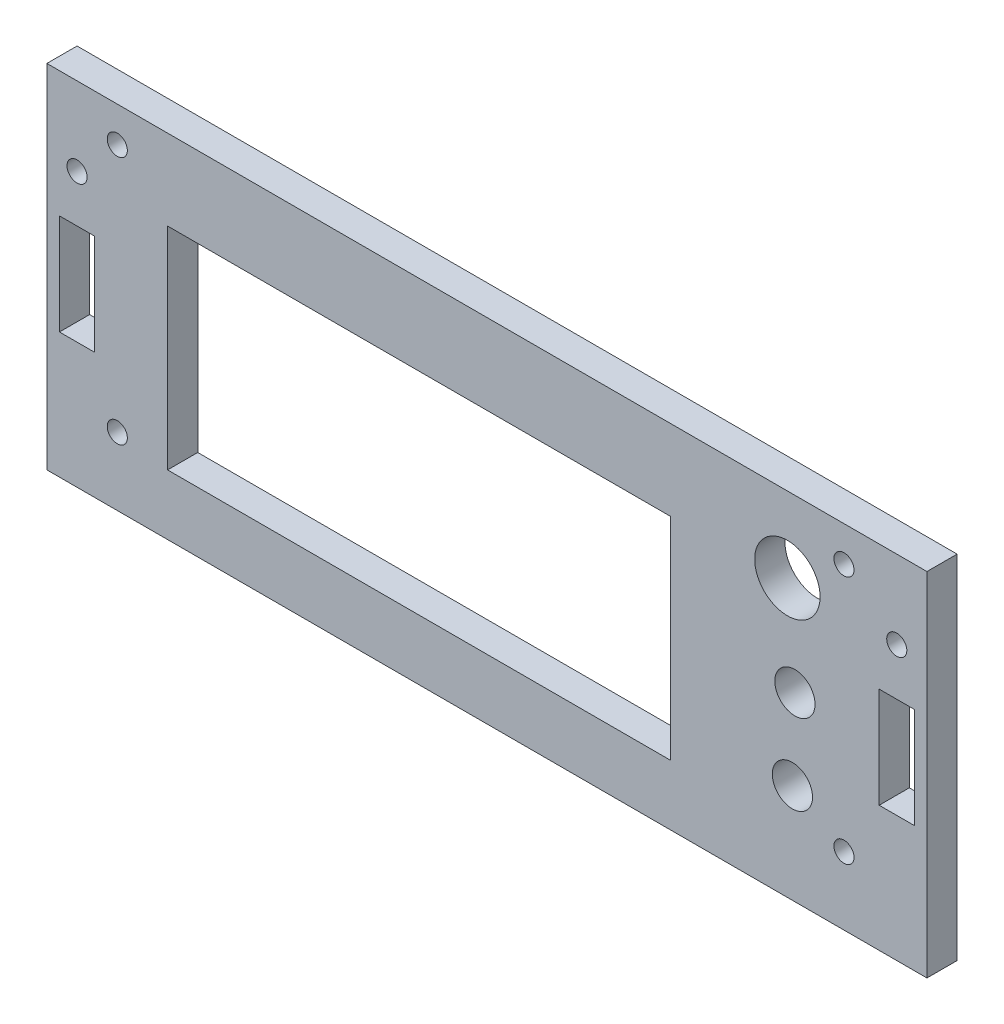
ISO-10303-21;
HEADER;
FILE_DESCRIPTION(('STEP AP214'),'2;1');
FILE_NAME('part.step','',(''),(''),'','','');
FILE_SCHEMA(('AUTOMOTIVE_DESIGN { 1 0 10303 214 1 1 1 1 }'));
ENDSEC;
DATA;
#1=APPLICATION_CONTEXT('core data for automotive mechanical design processes');
#2=APPLICATION_PROTOCOL_DEFINITION('international standard','automotive_design',2000,#1);
#3=PRODUCT_CONTEXT('',#1,'mechanical');
#4=PRODUCT('Part','Part','',(#3));
#5=PRODUCT_RELATED_PRODUCT_CATEGORY('part','',(#4));
#6=PRODUCT_DEFINITION_FORMATION('','',#4);
#7=PRODUCT_DEFINITION_CONTEXT('part definition',#1,'design');
#8=PRODUCT_DEFINITION('design','',#6,#7);
#9=PRODUCT_DEFINITION_SHAPE('','',#8);
#10=(LENGTH_UNIT() NAMED_UNIT(*) SI_UNIT(.MILLI.,.METRE.));
#11=(NAMED_UNIT(*) PLANE_ANGLE_UNIT() SI_UNIT($,.RADIAN.));
#12=(NAMED_UNIT(*) SI_UNIT($,.STERADIAN.) SOLID_ANGLE_UNIT());
#13=UNCERTAINTY_MEASURE_WITH_UNIT(LENGTH_MEASURE(1.E-05),#10,'distance_accuracy_value','');
#14=(GEOMETRIC_REPRESENTATION_CONTEXT(3) GLOBAL_UNCERTAINTY_ASSIGNED_CONTEXT((#13)) GLOBAL_UNIT_ASSIGNED_CONTEXT((#10,
#11,#12)) REPRESENTATION_CONTEXT('',''));
#15=CARTESIAN_POINT('',(0.,0.,0.));
#16=DIRECTION('',(0.,0.,1.));
#17=DIRECTION('',(1.,0.,0.));
#18=AXIS2_PLACEMENT_3D('',#15,#16,#17);
#19=CARTESIAN_POINT('',(0.,0.,6.));
#20=DIRECTION('',(0.,0.,1.));
#21=DIRECTION('',(1.,0.,0.));
#22=AXIS2_PLACEMENT_3D('',#19,#20,#21);
#23=PLANE('',#22);
#24=CARTESIAN_POINT('',(60.75,-15.25,6.));
#25=DIRECTION('',(0.,0.,1.));
#26=DIRECTION('',(1.,0.,0.));
#27=AXIS2_PLACEMENT_3D('',#24,#25,#26);
#28=CIRCLE('',#27,4.00000000000002);
#29=CARTESIAN_POINT('',(64.75,-15.25,6.));
#30=VERTEX_POINT('',#29);
#31=EDGE_CURVE('E388',#30,#30,#28,.T.);
#32=ORIENTED_EDGE('',*,*,#31,.F.);
#33=EDGE_LOOP('',(#32));
#34=FACE_BOUND('',#33,.T.);
#35=CARTESIAN_POINT('',(61.25,1.,6.));
#36=DIRECTION('',(0.,0.,1.));
#37=DIRECTION('',(1.,0.,0.));
#38=AXIS2_PLACEMENT_3D('',#35,#36,#37);
#39=CIRCLE('',#38,4.00000000000002);
#40=CARTESIAN_POINT('',(65.25,1.,6.));
#41=VERTEX_POINT('',#40);
#42=EDGE_CURVE('E382',#41,#41,#39,.T.);
#43=ORIENTED_EDGE('',*,*,#42,.F.);
#44=EDGE_LOOP('',(#43));
#45=FACE_BOUND('',#44,.T.);
#46=CARTESIAN_POINT('',(59.75,20.,6.));
#47=DIRECTION('',(0.,0.,1.));
#48=DIRECTION('',(1.,0.,0.));
#49=AXIS2_PLACEMENT_3D('',#46,#47,#48);
#50=CIRCLE('',#49,6.49999999999997);
#51=CARTESIAN_POINT('',(66.25,20.,6.));
#52=VERTEX_POINT('',#51);
#53=EDGE_CURVE('E376',#52,#52,#50,.T.);
#54=ORIENTED_EDGE('',*,*,#53,.F.);
#55=EDGE_LOOP('',(#54));
#56=FACE_BOUND('',#55,.T.);
#57=CARTESIAN_POINT('',(-73.5,-21.5,6.));
#58=DIRECTION('',(0.,0.,1.));
#59=DIRECTION('',(1.,0.,0.));
#60=AXIS2_PLACEMENT_3D('',#57,#58,#59);
#61=CIRCLE('',#60,2.00000000000001);
#62=CARTESIAN_POINT('',(-71.5,-21.5,6.));
#63=VERTEX_POINT('',#62);
#64=EDGE_CURVE('E370',#63,#63,#61,.T.);
#65=ORIENTED_EDGE('',*,*,#64,.F.);
#66=EDGE_LOOP('',(#65));
#67=FACE_BOUND('',#66,.T.);
#68=CARTESIAN_POINT('',(71.,-21.5,6.));
#69=DIRECTION('',(0.,0.,1.));
#70=DIRECTION('',(1.,0.,0.));
#71=AXIS2_PLACEMENT_3D('',#68,#69,#70);
#72=CIRCLE('',#71,2.);
#73=CARTESIAN_POINT('',(73.,-21.5,6.));
#74=VERTEX_POINT('',#73);
#75=EDGE_CURVE('E364',#74,#74,#72,.T.);
#76=ORIENTED_EDGE('',*,*,#75,.F.);
#77=EDGE_LOOP('',(#76));
#78=FACE_BOUND('',#77,.T.);
#79=CARTESIAN_POINT('',(71.,28.,6.));
#80=DIRECTION('',(0.,0.,1.));
#81=DIRECTION('',(1.,0.,0.));
#82=AXIS2_PLACEMENT_3D('',#79,#80,#81);
#83=CIRCLE('',#82,2.);
#84=CARTESIAN_POINT('',(73.,28.,6.));
#85=VERTEX_POINT('',#84);
#86=EDGE_CURVE('E358',#85,#85,#83,.T.);
#87=ORIENTED_EDGE('',*,*,#86,.F.);
#88=EDGE_LOOP('',(#87));
#89=FACE_BOUND('',#88,.T.);
#90=CARTESIAN_POINT('',(-73.5,28.,6.));
#91=DIRECTION('',(0.,0.,1.));
#92=DIRECTION('',(1.,0.,0.));
#93=AXIS2_PLACEMENT_3D('',#90,#91,#92);
#94=CIRCLE('',#93,2.);
#95=CARTESIAN_POINT('',(-71.5,28.,6.));
#96=VERTEX_POINT('',#95);
#97=EDGE_CURVE('E350',#96,#96,#94,.T.);
#98=ORIENTED_EDGE('',*,*,#97,.F.);
#99=EDGE_LOOP('',(#98));
#100=FACE_BOUND('',#99,.T.);
#101=DIRECTION('',(-1.,0.,0.));
#102=VECTOR('',#101,1.);
#103=CARTESIAN_POINT('',(85.,-10.,6.));
#104=LINE('',#103,#102);
#105=CARTESIAN_POINT('',(85.,-10.,6.));
#106=VERTEX_POINT('',#105);
#107=CARTESIAN_POINT('',(78.,-10.,6.));
#108=VERTEX_POINT('',#107);
#109=EDGE_CURVE('E175',#106,#108,#104,.T.);
#110=ORIENTED_EDGE('',*,*,#109,.T.);
#111=DIRECTION('',(0.,1.,0.));
#112=VECTOR('',#111,1.);
#113=CARTESIAN_POINT('',(78.,10.,6.));
#114=LINE('',#113,#112);
#115=CARTESIAN_POINT('',(78.,10.,6.));
#116=VERTEX_POINT('',#115);
#117=EDGE_CURVE('E48',#108,#116,#114,.T.);
#118=ORIENTED_EDGE('',*,*,#117,.T.);
#119=DIRECTION('',(1.,0.,0.));
#120=VECTOR('',#119,1.);
#121=CARTESIAN_POINT('',(85.,10.,6.));
#122=LINE('',#121,#120);
#123=CARTESIAN_POINT('',(85.,10.,6.));
#124=VERTEX_POINT('',#123);
#125=EDGE_CURVE('E163',#116,#124,#122,.T.);
#126=ORIENTED_EDGE('',*,*,#125,.T.);
#127=DIRECTION('',(0.,-1.,0.));
#128=VECTOR('',#127,1.);
#129=CARTESIAN_POINT('',(85.,10.,6.));
#130=LINE('',#129,#128);
#131=EDGE_CURVE('E166',#124,#106,#130,.T.);
#132=ORIENTED_EDGE('',*,*,#131,.T.);
#133=EDGE_LOOP('',(#110,#118,#126,#132));
#134=FACE_BOUND('',#133,.T.);
#135=CARTESIAN_POINT('',(-81.5,19.4,6.));
#136=DIRECTION('',(0.,0.,1.));
#137=DIRECTION('',(1.,0.,0.));
#138=AXIS2_PLACEMENT_3D('',#135,#136,#137);
#139=CIRCLE('',#138,2.);
#140=CARTESIAN_POINT('',(-79.5,19.4,6.));
#141=VERTEX_POINT('',#140);
#142=EDGE_CURVE('E182',#141,#141,#139,.T.);
#143=ORIENTED_EDGE('',*,*,#142,.F.);
#144=EDGE_LOOP('',(#143));
#145=FACE_BOUND('',#144,.T.);
#146=DIRECTION('',(0.,1.,0.));
#147=VECTOR('',#146,1.);
#148=CARTESIAN_POINT('',(-78.,10.,6.));
#149=LINE('',#148,#147);
#150=CARTESIAN_POINT('',(-78.,-10.,6.));
#151=VERTEX_POINT('',#150);
#152=CARTESIAN_POINT('',(-78.,10.,6.));
#153=VERTEX_POINT('',#152);
#154=EDGE_CURVE('E189',#151,#153,#149,.T.);
#155=ORIENTED_EDGE('',*,*,#154,.F.);
#156=DIRECTION('',(1.,0.,0.));
#157=VECTOR('',#156,1.);
#158=CARTESIAN_POINT('',(-85.,-10.,6.));
#159=LINE('',#158,#157);
#160=CARTESIAN_POINT('',(-85.,-10.,6.));
#161=VERTEX_POINT('',#160);
#162=EDGE_CURVE('E196',#161,#151,#159,.T.);
#163=ORIENTED_EDGE('',*,*,#162,.F.);
#164=DIRECTION('',(0.,-1.,0.));
#165=VECTOR('',#164,1.);
#166=CARTESIAN_POINT('',(-85.,10.,6.));
#167=LINE('',#166,#165);
#168=CARTESIAN_POINT('',(-85.,10.,6.));
#169=VERTEX_POINT('',#168);
#170=EDGE_CURVE('E210',#169,#161,#167,.T.);
#171=ORIENTED_EDGE('',*,*,#170,.F.);
#172=DIRECTION('',(-1.,0.,0.));
#173=VECTOR('',#172,1.);
#174=CARTESIAN_POINT('',(-85.,10.,6.));
#175=LINE('',#174,#173);
#176=EDGE_CURVE('E207',#153,#169,#175,.T.);
#177=ORIENTED_EDGE('',*,*,#176,.F.);
#178=EDGE_LOOP('',(#155,#163,#171,#177));
#179=FACE_BOUND('',#178,.T.);
#180=DIRECTION('',(0.,1.,0.));
#181=VECTOR('',#180,1.);
#182=CARTESIAN_POINT('',(87.5,35.,6.));
#183=LINE('',#182,#181);
#184=CARTESIAN_POINT('',(87.5,-35.,6.));
#185=VERTEX_POINT('',#184);
#186=CARTESIAN_POINT('',(87.5,35.,6.));
#187=VERTEX_POINT('',#186);
#188=EDGE_CURVE('E255',#185,#187,#183,.T.);
#189=ORIENTED_EDGE('',*,*,#188,.T.);
#190=DIRECTION('',(-1.,0.,0.));
#191=VECTOR('',#190,1.);
#192=CARTESIAN_POINT('',(-87.5,35.,6.));
#193=LINE('',#192,#191);
#194=CARTESIAN_POINT('',(-87.5,35.,6.));
#195=VERTEX_POINT('',#194);
#196=EDGE_CURVE('E258',#187,#195,#193,.T.);
#197=ORIENTED_EDGE('',*,*,#196,.T.);
#198=DIRECTION('',(0.,-1.,0.));
#199=VECTOR('',#198,1.);
#200=CARTESIAN_POINT('',(-87.5,35.,6.));
#201=LINE('',#200,#199);
#202=CARTESIAN_POINT('',(-87.5,-35.,6.));
#203=VERTEX_POINT('',#202);
#204=EDGE_CURVE('E261',#195,#203,#201,.T.);
#205=ORIENTED_EDGE('',*,*,#204,.T.);
#206=DIRECTION('',(1.,0.,0.));
#207=VECTOR('',#206,1.);
#208=CARTESIAN_POINT('',(-87.5,-35.,6.));
#209=LINE('',#208,#207);
#210=EDGE_CURVE('E263',#203,#185,#209,.T.);
#211=ORIENTED_EDGE('',*,*,#210,.T.);
#212=EDGE_LOOP('',(#189,#197,#205,#211));
#213=FACE_BOUND('',#212,.T.);
#214=DIRECTION('',(-1.,0.,0.));
#215=VECTOR('',#214,1.);
#216=CARTESIAN_POINT('',(-63.5,19.,6.));
#217=LINE('',#216,#215);
#218=CARTESIAN_POINT('',(36.5,19.,6.));
#219=VERTEX_POINT('',#218);
#220=CARTESIAN_POINT('',(-63.5,19.,6.));
#221=VERTEX_POINT('',#220);
#222=EDGE_CURVE('E226',#219,#221,#217,.T.);
#223=ORIENTED_EDGE('',*,*,#222,.F.);
#224=DIRECTION('',(0.,1.,0.));
#225=VECTOR('',#224,1.);
#226=CARTESIAN_POINT('',(36.5,19.,6.));
#227=LINE('',#226,#225);
#228=CARTESIAN_POINT('',(36.5,-23.,6.));
#229=VERTEX_POINT('',#228);
#230=EDGE_CURVE('E224',#229,#219,#227,.T.);
#231=ORIENTED_EDGE('',*,*,#230,.F.);
#232=DIRECTION('',(1.,0.,0.));
#233=VECTOR('',#232,1.);
#234=CARTESIAN_POINT('',(-63.5,-23.,6.));
#235=LINE('',#234,#233);
#236=CARTESIAN_POINT('',(-63.5,-23.,6.));
#237=VERTEX_POINT('',#236);
#238=EDGE_CURVE('E232',#237,#229,#235,.T.);
#239=ORIENTED_EDGE('',*,*,#238,.F.);
#240=DIRECTION('',(0.,-1.,0.));
#241=VECTOR('',#240,1.);
#242=CARTESIAN_POINT('',(-63.5,19.,6.));
#243=LINE('',#242,#241);
#244=EDGE_CURVE('E229',#221,#237,#243,.T.);
#245=ORIENTED_EDGE('',*,*,#244,.F.);
#246=EDGE_LOOP('',(#223,#231,#239,#245));
#247=FACE_BOUND('',#246,.T.);
#248=CARTESIAN_POINT('',(81.5,19.4,6.));
#249=DIRECTION('',(0.,0.,-1.));
#250=DIRECTION('',(-1.,0.,0.));
#251=AXIS2_PLACEMENT_3D('',#248,#249,#250);
#252=CIRCLE('',#251,2.);
#253=CARTESIAN_POINT('',(79.5,19.4,6.));
#254=VERTEX_POINT('',#253);
#255=EDGE_CURVE('E169',#254,#254,#252,.T.);
#256=ORIENTED_EDGE('',*,*,#255,.T.);
#257=EDGE_LOOP('',(#256));
#258=FACE_BOUND('',#257,.T.);
#259=ADVANCED_FACE('F33',(#34,#45,#56,#67,#78,#89,#100,#134,#145,#179,#213,#247,#258),#23,.T.);
#260=CARTESIAN_POINT('',(0.,0.,0.));
#261=DIRECTION('',(0.,0.,1.));
#262=DIRECTION('',(1.,0.,0.));
#263=AXIS2_PLACEMENT_3D('',#260,#261,#262);
#264=PLANE('',#263);
#265=CARTESIAN_POINT('',(60.75,-15.25,0.));
#266=DIRECTION('',(0.,0.,1.));
#267=DIRECTION('',(1.,0.,0.));
#268=AXIS2_PLACEMENT_3D('',#265,#266,#267);
#269=CIRCLE('',#268,4.00000000000002);
#270=CARTESIAN_POINT('',(64.75,-15.25,0.));
#271=VERTEX_POINT('',#270);
#272=EDGE_CURVE('E385',#271,#271,#269,.T.);
#273=ORIENTED_EDGE('',*,*,#272,.T.);
#274=EDGE_LOOP('',(#273));
#275=FACE_BOUND('',#274,.T.);
#276=CARTESIAN_POINT('',(61.25,1.,0.));
#277=DIRECTION('',(0.,0.,1.));
#278=DIRECTION('',(1.,0.,0.));
#279=AXIS2_PLACEMENT_3D('',#276,#277,#278);
#280=CIRCLE('',#279,4.00000000000002);
#281=CARTESIAN_POINT('',(65.25,1.,0.));
#282=VERTEX_POINT('',#281);
#283=EDGE_CURVE('E379',#282,#282,#280,.T.);
#284=ORIENTED_EDGE('',*,*,#283,.T.);
#285=EDGE_LOOP('',(#284));
#286=FACE_BOUND('',#285,.T.);
#287=CARTESIAN_POINT('',(59.75,20.,0.));
#288=DIRECTION('',(0.,0.,1.));
#289=DIRECTION('',(1.,0.,0.));
#290=AXIS2_PLACEMENT_3D('',#287,#288,#289);
#291=CIRCLE('',#290,6.49999999999997);
#292=CARTESIAN_POINT('',(66.25,20.,0.));
#293=VERTEX_POINT('',#292);
#294=EDGE_CURVE('E373',#293,#293,#291,.T.);
#295=ORIENTED_EDGE('',*,*,#294,.T.);
#296=EDGE_LOOP('',(#295));
#297=FACE_BOUND('',#296,.T.);
#298=CARTESIAN_POINT('',(-73.5,-21.5,0.));
#299=DIRECTION('',(0.,0.,1.));
#300=DIRECTION('',(1.,0.,0.));
#301=AXIS2_PLACEMENT_3D('',#298,#299,#300);
#302=CIRCLE('',#301,2.00000000000001);
#303=CARTESIAN_POINT('',(-71.5,-21.5,0.));
#304=VERTEX_POINT('',#303);
#305=EDGE_CURVE('E367',#304,#304,#302,.T.);
#306=ORIENTED_EDGE('',*,*,#305,.T.);
#307=EDGE_LOOP('',(#306));
#308=FACE_BOUND('',#307,.T.);
#309=CARTESIAN_POINT('',(71.,-21.5,0.));
#310=DIRECTION('',(0.,0.,1.));
#311=DIRECTION('',(1.,0.,0.));
#312=AXIS2_PLACEMENT_3D('',#309,#310,#311);
#313=CIRCLE('',#312,2.);
#314=CARTESIAN_POINT('',(73.,-21.5,0.));
#315=VERTEX_POINT('',#314);
#316=EDGE_CURVE('E361',#315,#315,#313,.T.);
#317=ORIENTED_EDGE('',*,*,#316,.T.);
#318=EDGE_LOOP('',(#317));
#319=FACE_BOUND('',#318,.T.);
#320=CARTESIAN_POINT('',(71.,28.,0.));
#321=DIRECTION('',(0.,0.,1.));
#322=DIRECTION('',(1.,0.,0.));
#323=AXIS2_PLACEMENT_3D('',#320,#321,#322);
#324=CIRCLE('',#323,2.);
#325=CARTESIAN_POINT('',(73.,28.,0.));
#326=VERTEX_POINT('',#325);
#327=EDGE_CURVE('E355',#326,#326,#324,.T.);
#328=ORIENTED_EDGE('',*,*,#327,.T.);
#329=EDGE_LOOP('',(#328));
#330=FACE_BOUND('',#329,.T.);
#331=CARTESIAN_POINT('',(-73.5,28.,0.));
#332=DIRECTION('',(0.,0.,1.));
#333=DIRECTION('',(1.,0.,0.));
#334=AXIS2_PLACEMENT_3D('',#331,#332,#333);
#335=CIRCLE('',#334,2.);
#336=CARTESIAN_POINT('',(-71.5,28.,0.));
#337=VERTEX_POINT('',#336);
#338=EDGE_CURVE('E347',#337,#337,#335,.T.);
#339=ORIENTED_EDGE('',*,*,#338,.T.);
#340=EDGE_LOOP('',(#339));
#341=FACE_BOUND('',#340,.T.);
#342=DIRECTION('',(0.,1.,0.));
#343=VECTOR('',#342,1.);
#344=CARTESIAN_POINT('',(78.,10.,0.));
#345=LINE('',#344,#343);
#346=CARTESIAN_POINT('',(78.,-10.,0.));
#347=VERTEX_POINT('',#346);
#348=CARTESIAN_POINT('',(78.,10.,0.));
#349=VERTEX_POINT('',#348);
#350=EDGE_CURVE('E154',#347,#349,#345,.T.);
#351=ORIENTED_EDGE('',*,*,#350,.F.);
#352=DIRECTION('',(-1.,0.,0.));
#353=VECTOR('',#352,1.);
#354=CARTESIAN_POINT('',(85.,-10.,0.));
#355=LINE('',#354,#353);
#356=CARTESIAN_POINT('',(85.,-10.,0.));
#357=VERTEX_POINT('',#356);
#358=EDGE_CURVE('E146',#357,#347,#355,.T.);
#359=ORIENTED_EDGE('',*,*,#358,.F.);
#360=DIRECTION('',(0.,-1.,0.));
#361=VECTOR('',#360,1.);
#362=CARTESIAN_POINT('',(85.,10.,0.));
#363=LINE('',#362,#361);
#364=CARTESIAN_POINT('',(85.,10.,0.));
#365=VERTEX_POINT('',#364);
#366=EDGE_CURVE('E153',#365,#357,#363,.T.);
#367=ORIENTED_EDGE('',*,*,#366,.F.);
#368=DIRECTION('',(1.,0.,0.));
#369=VECTOR('',#368,1.);
#370=CARTESIAN_POINT('',(85.,10.,0.));
#371=LINE('',#370,#369);
#372=EDGE_CURVE('E158',#349,#365,#371,.T.);
#373=ORIENTED_EDGE('',*,*,#372,.F.);
#374=EDGE_LOOP('',(#351,#359,#367,#373));
#375=FACE_BOUND('',#374,.T.);
#376=CARTESIAN_POINT('',(-81.5,19.4,0.));
#377=DIRECTION('',(0.,0.,1.));
#378=DIRECTION('',(1.,0.,0.));
#379=AXIS2_PLACEMENT_3D('',#376,#377,#378);
#380=CIRCLE('',#379,2.);
#381=CARTESIAN_POINT('',(-79.5,19.4,0.));
#382=VERTEX_POINT('',#381);
#383=EDGE_CURVE('E186',#382,#382,#380,.T.);
#384=ORIENTED_EDGE('',*,*,#383,.T.);
#385=EDGE_LOOP('',(#384));
#386=FACE_BOUND('',#385,.T.);
#387=DIRECTION('',(1.,0.,0.));
#388=VECTOR('',#387,1.);
#389=CARTESIAN_POINT('',(-85.,-10.,0.));
#390=LINE('',#389,#388);
#391=CARTESIAN_POINT('',(-85.,-10.,0.));
#392=VERTEX_POINT('',#391);
#393=CARTESIAN_POINT('',(-78.,-10.,0.));
#394=VERTEX_POINT('',#393);
#395=EDGE_CURVE('E202',#392,#394,#390,.T.);
#396=ORIENTED_EDGE('',*,*,#395,.T.);
#397=DIRECTION('',(0.,1.,0.));
#398=VECTOR('',#397,1.);
#399=CARTESIAN_POINT('',(-78.,10.,0.));
#400=LINE('',#399,#398);
#401=CARTESIAN_POINT('',(-78.,10.,0.));
#402=VERTEX_POINT('',#401);
#403=EDGE_CURVE('E192',#394,#402,#400,.T.);
#404=ORIENTED_EDGE('',*,*,#403,.T.);
#405=DIRECTION('',(-1.,0.,0.));
#406=VECTOR('',#405,1.);
#407=CARTESIAN_POINT('',(-85.,10.,0.));
#408=LINE('',#407,#406);
#409=CARTESIAN_POINT('',(-85.,10.,0.));
#410=VERTEX_POINT('',#409);
#411=EDGE_CURVE('E195',#402,#410,#408,.T.);
#412=ORIENTED_EDGE('',*,*,#411,.T.);
#413=DIRECTION('',(0.,-1.,0.));
#414=VECTOR('',#413,1.);
#415=CARTESIAN_POINT('',(-85.,10.,0.));
#416=LINE('',#415,#414);
#417=EDGE_CURVE('E199',#410,#392,#416,.T.);
#418=ORIENTED_EDGE('',*,*,#417,.T.);
#419=EDGE_LOOP('',(#396,#404,#412,#418));
#420=FACE_BOUND('',#419,.T.);
#421=DIRECTION('',(0.,1.,0.));
#422=VECTOR('',#421,1.);
#423=CARTESIAN_POINT('',(87.5,35.,0.));
#424=LINE('',#423,#422);
#425=CARTESIAN_POINT('',(87.5,-35.,0.));
#426=VERTEX_POINT('',#425);
#427=CARTESIAN_POINT('',(87.5,35.,0.));
#428=VERTEX_POINT('',#427);
#429=EDGE_CURVE('E254',#426,#428,#424,.T.);
#430=ORIENTED_EDGE('',*,*,#429,.F.);
#431=DIRECTION('',(1.,0.,0.));
#432=VECTOR('',#431,1.);
#433=CARTESIAN_POINT('',(-87.5,-35.,0.));
#434=LINE('',#433,#432);
#435=CARTESIAN_POINT('',(-87.5,-35.,0.));
#436=VERTEX_POINT('',#435);
#437=EDGE_CURVE('E259',#436,#426,#434,.T.);
#438=ORIENTED_EDGE('',*,*,#437,.F.);
#439=DIRECTION('',(0.,-1.,0.));
#440=VECTOR('',#439,1.);
#441=CARTESIAN_POINT('',(-87.5,35.,0.));
#442=LINE('',#441,#440);
#443=CARTESIAN_POINT('',(-87.5,35.,0.));
#444=VERTEX_POINT('',#443);
#445=EDGE_CURVE('E270',#444,#436,#442,.T.);
#446=ORIENTED_EDGE('',*,*,#445,.F.);
#447=DIRECTION('',(-1.,0.,0.));
#448=VECTOR('',#447,1.);
#449=CARTESIAN_POINT('',(-87.5,35.,0.));
#450=LINE('',#449,#448);
#451=EDGE_CURVE('E268',#428,#444,#450,.T.);
#452=ORIENTED_EDGE('',*,*,#451,.F.);
#453=EDGE_LOOP('',(#430,#438,#446,#452));
#454=FACE_BOUND('',#453,.T.);
#455=DIRECTION('',(0.,1.,0.));
#456=VECTOR('',#455,1.);
#457=CARTESIAN_POINT('',(36.5,19.,0.));
#458=LINE('',#457,#456);
#459=CARTESIAN_POINT('',(36.5,-23.,0.));
#460=VERTEX_POINT('',#459);
#461=CARTESIAN_POINT('',(36.5,19.,0.));
#462=VERTEX_POINT('',#461);
#463=EDGE_CURVE('E217',#460,#462,#458,.T.);
#464=ORIENTED_EDGE('',*,*,#463,.T.);
#465=DIRECTION('',(-1.,0.,0.));
#466=VECTOR('',#465,1.);
#467=CARTESIAN_POINT('',(-63.5,19.,0.));
#468=LINE('',#467,#466);
#469=CARTESIAN_POINT('',(-63.5,19.,0.));
#470=VERTEX_POINT('',#469);
#471=EDGE_CURVE('E237',#462,#470,#468,.T.);
#472=ORIENTED_EDGE('',*,*,#471,.T.);
#473=DIRECTION('',(0.,-1.,0.));
#474=VECTOR('',#473,1.);
#475=CARTESIAN_POINT('',(-63.5,19.,0.));
#476=LINE('',#475,#474);
#477=CARTESIAN_POINT('',(-63.5,-23.,0.));
#478=VERTEX_POINT('',#477);
#479=EDGE_CURVE('E240',#470,#478,#476,.T.);
#480=ORIENTED_EDGE('',*,*,#479,.T.);
#481=DIRECTION('',(1.,0.,0.));
#482=VECTOR('',#481,1.);
#483=CARTESIAN_POINT('',(-63.5,-23.,0.));
#484=LINE('',#483,#482);
#485=EDGE_CURVE('E227',#478,#460,#484,.T.);
#486=ORIENTED_EDGE('',*,*,#485,.T.);
#487=EDGE_LOOP('',(#464,#472,#480,#486));
#488=FACE_BOUND('',#487,.T.);
#489=CARTESIAN_POINT('',(81.5,19.4,0.));
#490=DIRECTION('',(0.,0.,-1.));
#491=DIRECTION('',(-1.,0.,0.));
#492=AXIS2_PLACEMENT_3D('',#489,#490,#491);
#493=CIRCLE('',#492,2.);
#494=CARTESIAN_POINT('',(79.5,19.4,0.));
#495=VERTEX_POINT('',#494);
#496=EDGE_CURVE('E176',#495,#495,#493,.T.);
#497=ORIENTED_EDGE('',*,*,#496,.F.);
#498=EDGE_LOOP('',(#497));
#499=FACE_BOUND('',#498,.T.);
#500=ADVANCED_FACE('F161',(#275,#286,#297,#308,#319,#330,#341,#375,#386,#420,#454,#488,#499),
#264,.F.);
#501=CARTESIAN_POINT('',(87.5,35.,6.));
#502=DIRECTION('',(-1.,0.,0.));
#503=DIRECTION('',(0.,0.,1.));
#504=AXIS2_PLACEMENT_3D('',#501,#502,#503);
#505=PLANE('',#504);
#506=ORIENTED_EDGE('',*,*,#429,.T.);
#507=DIRECTION('',(0.,0.,-1.));
#508=VECTOR('',#507,1.);
#509=CARTESIAN_POINT('',(87.5,35.,6.));
#510=LINE('',#509,#508);
#511=EDGE_CURVE('E11',#187,#428,#510,.T.);
#512=ORIENTED_EDGE('',*,*,#511,.F.);
#513=ORIENTED_EDGE('',*,*,#188,.F.);
#514=DIRECTION('',(0.,0.,-1.));
#515=VECTOR('',#514,1.);
#516=CARTESIAN_POINT('',(87.5,-35.,6.));
#517=LINE('',#516,#515);
#518=EDGE_CURVE('E265',#185,#426,#517,.T.);
#519=ORIENTED_EDGE('',*,*,#518,.T.);
#520=EDGE_LOOP('',(#506,#512,#513,#519));
#521=FACE_BOUND('',#520,.T.);
#522=ADVANCED_FACE('F35',(#521),#505,.F.);
#523=CARTESIAN_POINT('',(-87.5,35.,6.));
#524=DIRECTION('',(0.,-1.,0.));
#525=DIRECTION('',(0.,0.,-1.));
#526=AXIS2_PLACEMENT_3D('',#523,#524,#525);
#527=PLANE('',#526);
#528=ORIENTED_EDGE('',*,*,#451,.T.);
#529=DIRECTION('',(0.,0.,-1.));
#530=VECTOR('',#529,1.);
#531=CARTESIAN_POINT('',(-87.5,35.,6.));
#532=LINE('',#531,#530);
#533=EDGE_CURVE('E41',#195,#444,#532,.T.);
#534=ORIENTED_EDGE('',*,*,#533,.F.);
#535=ORIENTED_EDGE('',*,*,#196,.F.);
#536=ORIENTED_EDGE('',*,*,#511,.T.);
#537=EDGE_LOOP('',(#528,#534,#535,#536));
#538=FACE_BOUND('',#537,.T.);
#539=ADVANCED_FACE('F298',(#538),#527,.F.);
#540=CARTESIAN_POINT('',(-87.5,35.,6.));
#541=DIRECTION('',(1.,0.,0.));
#542=DIRECTION('',(0.,1.,0.));
#543=AXIS2_PLACEMENT_3D('',#540,#541,#542);
#544=PLANE('',#543);
#545=ORIENTED_EDGE('',*,*,#445,.T.);
#546=DIRECTION('',(0.,0.,-1.));
#547=VECTOR('',#546,1.);
#548=CARTESIAN_POINT('',(-87.5,-35.,6.));
#549=LINE('',#548,#547);
#550=EDGE_CURVE('E275',#203,#436,#549,.T.);
#551=ORIENTED_EDGE('',*,*,#550,.F.);
#552=ORIENTED_EDGE('',*,*,#204,.F.);
#553=ORIENTED_EDGE('',*,*,#533,.T.);
#554=EDGE_LOOP('',(#545,#551,#552,#553));
#555=FACE_BOUND('',#554,.T.);
#556=ADVANCED_FACE('F282',(#555),#544,.F.);
#557=CARTESIAN_POINT('',(-87.5,-35.,6.));
#558=DIRECTION('',(0.,1.,0.));
#559=DIRECTION('',(0.,0.,1.));
#560=AXIS2_PLACEMENT_3D('',#557,#558,#559);
#561=PLANE('',#560);
#562=ORIENTED_EDGE('',*,*,#437,.T.);
#563=ORIENTED_EDGE('',*,*,#518,.F.);
#564=ORIENTED_EDGE('',*,*,#210,.F.);
#565=ORIENTED_EDGE('',*,*,#550,.T.);
#566=EDGE_LOOP('',(#562,#563,#564,#565));
#567=FACE_BOUND('',#566,.T.);
#568=ADVANCED_FACE('F291',(#567),#561,.F.);
#569=CARTESIAN_POINT('',(36.5,19.,6.));
#570=DIRECTION('',(-1.,0.,0.));
#571=DIRECTION('',(0.,-1.,0.));
#572=AXIS2_PLACEMENT_3D('',#569,#570,#571);
#573=PLANE('',#572);
#574=ORIENTED_EDGE('',*,*,#463,.F.);
#575=DIRECTION('',(0.,0.,-1.));
#576=VECTOR('',#575,1.);
#577=CARTESIAN_POINT('',(36.5,-23.,6.));
#578=LINE('',#577,#576);
#579=EDGE_CURVE('E234',#229,#460,#578,.T.);
#580=ORIENTED_EDGE('',*,*,#579,.F.);
#581=ORIENTED_EDGE('',*,*,#230,.T.);
#582=DIRECTION('',(0.,0.,-1.));
#583=VECTOR('',#582,1.);
#584=CARTESIAN_POINT('',(36.5,19.,6.));
#585=LINE('',#584,#583);
#586=EDGE_CURVE('E251',#219,#462,#585,.T.);
#587=ORIENTED_EDGE('',*,*,#586,.T.);
#588=EDGE_LOOP('',(#574,#580,#581,#587));
#589=FACE_BOUND('',#588,.T.);
#590=ADVANCED_FACE('F316',(#589),#573,.T.);
#591=CARTESIAN_POINT('',(-63.5,19.,6.));
#592=DIRECTION('',(0.,-1.,0.));
#593=DIRECTION('',(0.,0.,-1.));
#594=AXIS2_PLACEMENT_3D('',#591,#592,#593);
#595=PLANE('',#594);
#596=ORIENTED_EDGE('',*,*,#471,.F.);
#597=ORIENTED_EDGE('',*,*,#586,.F.);
#598=ORIENTED_EDGE('',*,*,#222,.T.);
#599=DIRECTION('',(0.,0.,-1.));
#600=VECTOR('',#599,1.);
#601=CARTESIAN_POINT('',(-63.5,19.,6.));
#602=LINE('',#601,#600);
#603=EDGE_CURVE('E249',#221,#470,#602,.T.);
#604=ORIENTED_EDGE('',*,*,#603,.T.);
#605=EDGE_LOOP('',(#596,#597,#598,#604));
#606=FACE_BOUND('',#605,.T.);
#607=ADVANCED_FACE('F323',(#606),#595,.T.);
#608=CARTESIAN_POINT('',(-63.5,19.,6.));
#609=DIRECTION('',(1.,0.,0.));
#610=DIRECTION('',(0.,0.,-1.));
#611=AXIS2_PLACEMENT_3D('',#608,#609,#610);
#612=PLANE('',#611);
#613=ORIENTED_EDGE('',*,*,#479,.F.);
#614=ORIENTED_EDGE('',*,*,#603,.F.);
#615=ORIENTED_EDGE('',*,*,#244,.T.);
#616=DIRECTION('',(0.,0.,-1.));
#617=VECTOR('',#616,1.);
#618=CARTESIAN_POINT('',(-63.5,-23.,6.));
#619=LINE('',#618,#617);
#620=EDGE_CURVE('E247',#237,#478,#619,.T.);
#621=ORIENTED_EDGE('',*,*,#620,.T.);
#622=EDGE_LOOP('',(#613,#614,#615,#621));
#623=FACE_BOUND('',#622,.T.);
#624=ADVANCED_FACE('F328',(#623),#612,.T.);
#625=CARTESIAN_POINT('',(-63.5,-23.,6.));
#626=DIRECTION('',(0.,1.,0.));
#627=DIRECTION('',(-1.,0.,0.));
#628=AXIS2_PLACEMENT_3D('',#625,#626,#627);
#629=PLANE('',#628);
#630=ORIENTED_EDGE('',*,*,#485,.F.);
#631=ORIENTED_EDGE('',*,*,#620,.F.);
#632=ORIENTED_EDGE('',*,*,#238,.T.);
#633=ORIENTED_EDGE('',*,*,#579,.T.);
#634=EDGE_LOOP('',(#630,#631,#632,#633));
#635=FACE_BOUND('',#634,.T.);
#636=ADVANCED_FACE('F335',(#635),#629,.T.);
#637=CARTESIAN_POINT('',(-78.,10.,0.));
#638=DIRECTION('',(1.,0.,0.));
#639=DIRECTION('',(0.,0.,-1.));
#640=AXIS2_PLACEMENT_3D('',#637,#638,#639);
#641=PLANE('',#640);
#642=ORIENTED_EDGE('',*,*,#154,.T.);
#643=DIRECTION('',(0.,0.,1.));
#644=VECTOR('',#643,1.);
#645=CARTESIAN_POINT('',(-78.,10.,0.));
#646=LINE('',#645,#644);
#647=EDGE_CURVE('E205',#402,#153,#646,.T.);
#648=ORIENTED_EDGE('',*,*,#647,.F.);
#649=ORIENTED_EDGE('',*,*,#403,.F.);
#650=DIRECTION('',(0.,0.,1.));
#651=VECTOR('',#650,1.);
#652=CARTESIAN_POINT('',(-78.,-10.,0.));
#653=LINE('',#652,#651);
#654=EDGE_CURVE('E215',#394,#151,#653,.T.);
#655=ORIENTED_EDGE('',*,*,#654,.T.);
#656=EDGE_LOOP('',(#642,#648,#649,#655));
#657=FACE_BOUND('',#656,.T.);
#658=ADVANCED_FACE('F451',(#657),#641,.F.);
#659=CARTESIAN_POINT('',(-85.,-10.,0.));
#660=DIRECTION('',(0.,-1.,0.));
#661=DIRECTION('',(1.,0.,0.));
#662=AXIS2_PLACEMENT_3D('',#659,#660,#661);
#663=PLANE('',#662);
#664=ORIENTED_EDGE('',*,*,#162,.T.);
#665=ORIENTED_EDGE('',*,*,#654,.F.);
#666=ORIENTED_EDGE('',*,*,#395,.F.);
#667=DIRECTION('',(0.,0.,1.));
#668=VECTOR('',#667,1.);
#669=CARTESIAN_POINT('',(-85.,-10.,0.));
#670=LINE('',#669,#668);
#671=EDGE_CURVE('E218',#392,#161,#670,.T.);
#672=ORIENTED_EDGE('',*,*,#671,.T.);
#673=EDGE_LOOP('',(#664,#665,#666,#672));
#674=FACE_BOUND('',#673,.T.);
#675=ADVANCED_FACE('F447',(#674),#663,.F.);
#676=CARTESIAN_POINT('',(-85.,10.,0.));
#677=DIRECTION('',(-1.,0.,0.));
#678=DIRECTION('',(0.,0.,1.));
#679=AXIS2_PLACEMENT_3D('',#676,#677,#678);
#680=PLANE('',#679);
#681=ORIENTED_EDGE('',*,*,#170,.T.);
#682=ORIENTED_EDGE('',*,*,#671,.F.);
#683=ORIENTED_EDGE('',*,*,#417,.F.);
#684=DIRECTION('',(0.,0.,1.));
#685=VECTOR('',#684,1.);
#686=CARTESIAN_POINT('',(-85.,10.,0.));
#687=LINE('',#686,#685);
#688=EDGE_CURVE('E220',#410,#169,#687,.T.);
#689=ORIENTED_EDGE('',*,*,#688,.T.);
#690=EDGE_LOOP('',(#681,#682,#683,#689));
#691=FACE_BOUND('',#690,.T.);
#692=ADVANCED_FACE('F450',(#691),#680,.F.);
#693=CARTESIAN_POINT('',(-85.,10.,0.));
#694=DIRECTION('',(0.,1.,0.));
#695=DIRECTION('',(-1.,0.,0.));
#696=AXIS2_PLACEMENT_3D('',#693,#694,#695);
#697=PLANE('',#696);
#698=ORIENTED_EDGE('',*,*,#176,.T.);
#699=ORIENTED_EDGE('',*,*,#688,.F.);
#700=ORIENTED_EDGE('',*,*,#411,.F.);
#701=ORIENTED_EDGE('',*,*,#647,.T.);
#702=EDGE_LOOP('',(#698,#699,#700,#701));
#703=FACE_BOUND('',#702,.T.);
#704=ADVANCED_FACE('F445',(#703),#697,.F.);
#705=CARTESIAN_POINT('',(-81.5,19.4,0.));
#706=DIRECTION('',(0.,0.,1.));
#707=DIRECTION('',(1.,0.,0.));
#708=AXIS2_PLACEMENT_3D('',#705,#706,#707);
#709=CYLINDRICAL_SURFACE('',#708,2.);
#710=ORIENTED_EDGE('',*,*,#383,.F.);
#711=EDGE_LOOP('',(#710));
#712=FACE_BOUND('',#711,.T.);
#713=ORIENTED_EDGE('',*,*,#142,.T.);
#714=EDGE_LOOP('',(#713));
#715=FACE_BOUND('',#714,.T.);
#716=ADVANCED_FACE('F442',(#712,#715),#709,.F.);
#717=CARTESIAN_POINT('',(78.,10.,0.));
#718=DIRECTION('',(1.,0.,0.));
#719=DIRECTION('',(0.,0.,-1.));
#720=AXIS2_PLACEMENT_3D('',#717,#718,#719);
#721=PLANE('',#720);
#722=ORIENTED_EDGE('',*,*,#117,.F.);
#723=DIRECTION('',(0.,0.,1.));
#724=VECTOR('',#723,1.);
#725=CARTESIAN_POINT('',(78.,-10.,0.));
#726=LINE('',#725,#724);
#727=EDGE_CURVE('E148',#347,#108,#726,.T.);
#728=ORIENTED_EDGE('',*,*,#727,.F.);
#729=ORIENTED_EDGE('',*,*,#350,.T.);
#730=DIRECTION('',(0.,0.,1.));
#731=VECTOR('',#730,1.);
#732=CARTESIAN_POINT('',(78.,10.,0.));
#733=LINE('',#732,#731);
#734=EDGE_CURVE('E180',#349,#116,#733,.T.);
#735=ORIENTED_EDGE('',*,*,#734,.T.);
#736=EDGE_LOOP('',(#722,#728,#729,#735));
#737=FACE_BOUND('',#736,.T.);
#738=ADVANCED_FACE('F156',(#737),#721,.T.);
#739=CARTESIAN_POINT('',(85.,10.,0.));
#740=DIRECTION('',(0.,-1.,0.));
#741=DIRECTION('',(1.,0.,0.));
#742=AXIS2_PLACEMENT_3D('',#739,#740,#741);
#743=PLANE('',#742);
#744=ORIENTED_EDGE('',*,*,#125,.F.);
#745=ORIENTED_EDGE('',*,*,#734,.F.);
#746=ORIENTED_EDGE('',*,*,#372,.T.);
#747=DIRECTION('',(0.,0.,1.));
#748=VECTOR('',#747,1.);
#749=CARTESIAN_POINT('',(85.,10.,0.));
#750=LINE('',#749,#748);
#751=EDGE_CURVE('E183',#365,#124,#750,.T.);
#752=ORIENTED_EDGE('',*,*,#751,.T.);
#753=EDGE_LOOP('',(#744,#745,#746,#752));
#754=FACE_BOUND('',#753,.T.);
#755=ADVANCED_FACE('F430',(#754),#743,.T.);
#756=CARTESIAN_POINT('',(85.,10.,0.));
#757=DIRECTION('',(-1.,0.,0.));
#758=DIRECTION('',(0.,0.,1.));
#759=AXIS2_PLACEMENT_3D('',#756,#757,#758);
#760=PLANE('',#759);
#761=ORIENTED_EDGE('',*,*,#131,.F.);
#762=ORIENTED_EDGE('',*,*,#751,.F.);
#763=ORIENTED_EDGE('',*,*,#366,.T.);
#764=DIRECTION('',(0.,0.,1.));
#765=VECTOR('',#764,1.);
#766=CARTESIAN_POINT('',(85.,-10.,0.));
#767=LINE('',#766,#765);
#768=EDGE_CURVE('E56',#357,#106,#767,.T.);
#769=ORIENTED_EDGE('',*,*,#768,.T.);
#770=EDGE_LOOP('',(#761,#762,#763,#769));
#771=FACE_BOUND('',#770,.T.);
#772=ADVANCED_FACE('F433',(#771),#760,.T.);
#773=CARTESIAN_POINT('',(85.,-10.,0.));
#774=DIRECTION('',(0.,1.,0.));
#775=DIRECTION('',(-1.,0.,0.));
#776=AXIS2_PLACEMENT_3D('',#773,#774,#775);
#777=PLANE('',#776);
#778=ORIENTED_EDGE('',*,*,#109,.F.);
#779=ORIENTED_EDGE('',*,*,#768,.F.);
#780=ORIENTED_EDGE('',*,*,#358,.T.);
#781=ORIENTED_EDGE('',*,*,#727,.T.);
#782=EDGE_LOOP('',(#778,#779,#780,#781));
#783=FACE_BOUND('',#782,.T.);
#784=ADVANCED_FACE('F147',(#783),#777,.T.);
#785=CARTESIAN_POINT('',(81.5,19.4,0.));
#786=DIRECTION('',(0.,0.,1.));
#787=DIRECTION('',(1.,0.,0.));
#788=AXIS2_PLACEMENT_3D('',#785,#786,#787);
#789=CYLINDRICAL_SURFACE('',#788,2.);
#790=ORIENTED_EDGE('',*,*,#496,.T.);
#791=EDGE_LOOP('',(#790));
#792=FACE_BOUND('',#791,.T.);
#793=ORIENTED_EDGE('',*,*,#255,.F.);
#794=EDGE_LOOP('',(#793));
#795=FACE_BOUND('',#794,.T.);
#796=ADVANCED_FACE('F425',(#792,#795),#789,.F.);
#797=CARTESIAN_POINT('',(-73.5,28.,0.));
#798=DIRECTION('',(0.,0.,1.));
#799=DIRECTION('',(1.,0.,0.));
#800=AXIS2_PLACEMENT_3D('',#797,#798,#799);
#801=CYLINDRICAL_SURFACE('',#800,2.);
#802=ORIENTED_EDGE('',*,*,#338,.F.);
#803=EDGE_LOOP('',(#802));
#804=FACE_BOUND('',#803,.T.);
#805=ORIENTED_EDGE('',*,*,#97,.T.);
#806=EDGE_LOOP('',(#805));
#807=FACE_BOUND('',#806,.T.);
#808=ADVANCED_FACE('F421',(#804,#807),#801,.F.);
#809=CARTESIAN_POINT('',(71.,28.,0.));
#810=DIRECTION('',(0.,0.,1.));
#811=DIRECTION('',(1.,0.,0.));
#812=AXIS2_PLACEMENT_3D('',#809,#810,#811);
#813=CYLINDRICAL_SURFACE('',#812,2.);
#814=ORIENTED_EDGE('',*,*,#327,.F.);
#815=EDGE_LOOP('',(#814));
#816=FACE_BOUND('',#815,.T.);
#817=ORIENTED_EDGE('',*,*,#86,.T.);
#818=EDGE_LOOP('',(#817));
#819=FACE_BOUND('',#818,.T.);
#820=ADVANCED_FACE('F417',(#816,#819),#813,.F.);
#821=CARTESIAN_POINT('',(71.,-21.5,0.));
#822=DIRECTION('',(0.,0.,1.));
#823=DIRECTION('',(1.,0.,0.));
#824=AXIS2_PLACEMENT_3D('',#821,#822,#823);
#825=CYLINDRICAL_SURFACE('',#824,2.);
#826=ORIENTED_EDGE('',*,*,#316,.F.);
#827=EDGE_LOOP('',(#826));
#828=FACE_BOUND('',#827,.T.);
#829=ORIENTED_EDGE('',*,*,#75,.T.);
#830=EDGE_LOOP('',(#829));
#831=FACE_BOUND('',#830,.T.);
#832=ADVANCED_FACE('F413',(#828,#831),#825,.F.);
#833=CARTESIAN_POINT('',(-73.5,-21.5,0.));
#834=DIRECTION('',(0.,0.,1.));
#835=DIRECTION('',(1.,0.,0.));
#836=AXIS2_PLACEMENT_3D('',#833,#834,#835);
#837=CYLINDRICAL_SURFACE('',#836,2.00000000000001);
#838=ORIENTED_EDGE('',*,*,#305,.F.);
#839=EDGE_LOOP('',(#838));
#840=FACE_BOUND('',#839,.T.);
#841=ORIENTED_EDGE('',*,*,#64,.T.);
#842=EDGE_LOOP('',(#841));
#843=FACE_BOUND('',#842,.T.);
#844=ADVANCED_FACE('F409',(#840,#843),#837,.F.);
#845=CARTESIAN_POINT('',(59.75,20.,0.));
#846=DIRECTION('',(0.,0.,1.));
#847=DIRECTION('',(1.,0.,0.));
#848=AXIS2_PLACEMENT_3D('',#845,#846,#847);
#849=CYLINDRICAL_SURFACE('',#848,6.49999999999997);
#850=ORIENTED_EDGE('',*,*,#294,.F.);
#851=EDGE_LOOP('',(#850));
#852=FACE_BOUND('',#851,.T.);
#853=ORIENTED_EDGE('',*,*,#53,.T.);
#854=EDGE_LOOP('',(#853));
#855=FACE_BOUND('',#854,.T.);
#856=ADVANCED_FACE('F403',(#852,#855),#849,.F.);
#857=CARTESIAN_POINT('',(61.25,1.,0.));
#858=DIRECTION('',(0.,0.,1.));
#859=DIRECTION('',(1.,0.,0.));
#860=AXIS2_PLACEMENT_3D('',#857,#858,#859);
#861=CYLINDRICAL_SURFACE('',#860,4.00000000000002);
#862=ORIENTED_EDGE('',*,*,#283,.F.);
#863=EDGE_LOOP('',(#862));
#864=FACE_BOUND('',#863,.T.);
#865=ORIENTED_EDGE('',*,*,#42,.T.);
#866=EDGE_LOOP('',(#865));
#867=FACE_BOUND('',#866,.T.);
#868=ADVANCED_FACE('F398',(#864,#867),#861,.F.);
#869=CARTESIAN_POINT('',(60.75,-15.25,0.));
#870=DIRECTION('',(0.,0.,1.));
#871=DIRECTION('',(1.,0.,0.));
#872=AXIS2_PLACEMENT_3D('',#869,#870,#871);
#873=CYLINDRICAL_SURFACE('',#872,4.00000000000002);
#874=ORIENTED_EDGE('',*,*,#272,.F.);
#875=EDGE_LOOP('',(#874));
#876=FACE_BOUND('',#875,.T.);
#877=ORIENTED_EDGE('',*,*,#31,.T.);
#878=EDGE_LOOP('',(#877));
#879=FACE_BOUND('',#878,.T.);
#880=ADVANCED_FACE('F395',(#876,#879),#873,.F.);
#881=CLOSED_SHELL('',(#259,#500,#522,#539,#556,#568,#590,#607,#624,#636,#658,#675,#692,#704,
#716,#738,#755,#772,#784,#796,#808,#820,#832,#844,#856,#868,#880));
#882=MANIFOLD_SOLID_BREP('B2',#881);
#883=ADVANCED_BREP_SHAPE_REPRESENTATION('',(#18,#882),#14);
#884=SHAPE_DEFINITION_REPRESENTATION(#9,#883);
ENDSEC;
END-ISO-10303-21;
